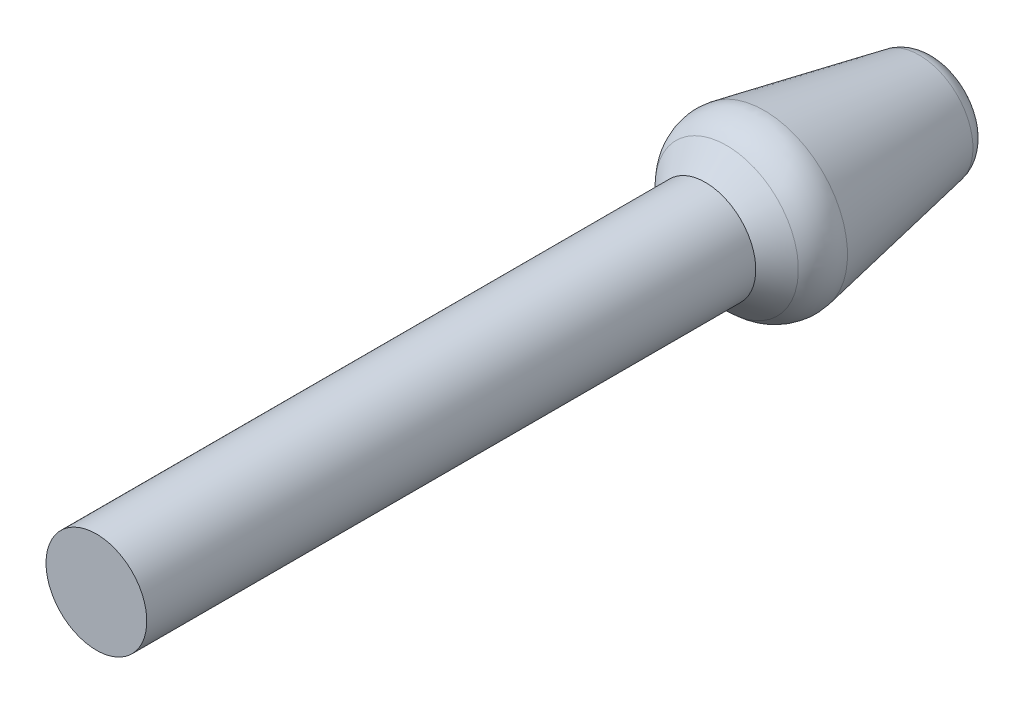
ISO-10303-21;
HEADER;
FILE_DESCRIPTION(('STEP AP214'),'2;1');
FILE_NAME('part.step','',(''),(''),'','','');
FILE_SCHEMA(('AUTOMOTIVE_DESIGN { 1 0 10303 214 1 1 1 1 }'));
ENDSEC;
DATA;
#1=APPLICATION_CONTEXT('core data for automotive mechanical design processes');
#2=APPLICATION_PROTOCOL_DEFINITION('international standard','automotive_design',2000,#1);
#3=PRODUCT_CONTEXT('',#1,'mechanical');
#4=PRODUCT('Part','Part','',(#3));
#5=PRODUCT_RELATED_PRODUCT_CATEGORY('part','',(#4));
#6=PRODUCT_DEFINITION_FORMATION('','',#4);
#7=PRODUCT_DEFINITION_CONTEXT('part definition',#1,'design');
#8=PRODUCT_DEFINITION('design','',#6,#7);
#9=PRODUCT_DEFINITION_SHAPE('','',#8);
#10=(LENGTH_UNIT() NAMED_UNIT(*) SI_UNIT(.MILLI.,.METRE.));
#11=(NAMED_UNIT(*) PLANE_ANGLE_UNIT() SI_UNIT($,.RADIAN.));
#12=(NAMED_UNIT(*) SI_UNIT($,.STERADIAN.) SOLID_ANGLE_UNIT());
#13=UNCERTAINTY_MEASURE_WITH_UNIT(LENGTH_MEASURE(1.E-05),#10,'distance_accuracy_value','');
#14=(GEOMETRIC_REPRESENTATION_CONTEXT(3) GLOBAL_UNCERTAINTY_ASSIGNED_CONTEXT((#13)) GLOBAL_UNIT_ASSIGNED_CONTEXT((#10,
#11,#12)) REPRESENTATION_CONTEXT('',''));
#15=CARTESIAN_POINT('',(0.,0.,0.));
#16=DIRECTION('',(0.,0.,1.));
#17=DIRECTION('',(1.,0.,0.));
#18=AXIS2_PLACEMENT_3D('',#15,#16,#17);
#19=CARTESIAN_POINT('',(-0.991133152501453,0.,-37.9508523224883));
#20=CARTESIAN_POINT('',(-0.991133152501453,-0.991133152501453,-37.9508523224883));
#21=CARTESIAN_POINT('',(0.,-0.991133152501453,-37.9508523224883));
#22=CARTESIAN_POINT('',(0.991133152501453,-0.991133152501453,-37.9508523224883));
#23=CARTESIAN_POINT('',(0.991133152501453,0.,-37.9508523224883));
#24=CARTESIAN_POINT('',(0.991133152501453,0.991133152501453,-37.9508523224883));
#25=CARTESIAN_POINT('',(0.,0.991133152501453,-37.9508523224883));
#26=CARTESIAN_POINT('',(-0.991133152501453,0.991133152501453,-37.9508523224883));
#27=CARTESIAN_POINT('',(-0.991133152501453,0.,-37.9508523224883));
#28=CARTESIAN_POINT('',(-1.0407755681846,0.,-37.6907755681845));
#29=CARTESIAN_POINT('',(-1.0407755681846,-1.0407755681846,-37.6907755681845));
#30=CARTESIAN_POINT('',(0.,-1.0407755681846,-37.6907755681845));
#31=CARTESIAN_POINT('',(1.0407755681846,-1.0407755681846,-37.6907755681845));
#32=CARTESIAN_POINT('',(1.0407755681846,0.,-37.6907755681845));
#33=CARTESIAN_POINT('',(1.0407755681846,1.0407755681846,-37.6907755681845));
#34=CARTESIAN_POINT('',(0.,1.0407755681846,-37.6907755681845));
#35=CARTESIAN_POINT('',(-1.0407755681846,1.0407755681846,-37.6907755681845));
#36=CARTESIAN_POINT('',(-1.0407755681846,0.,-37.6907755681845));
#37=CARTESIAN_POINT('',(-0.853553390593273,0.,-37.5035533905931));
#38=CARTESIAN_POINT('',(-0.853553390593274,-0.853553390593274,-37.5035533905931));
#39=CARTESIAN_POINT('',(0.,-0.853553390593273,-37.5035533905931));
#40=CARTESIAN_POINT('',(0.853553390593274,-0.853553390593274,-37.5035533905931));
#41=CARTESIAN_POINT('',(0.853553390593273,0.,-37.5035533905931));
#42=CARTESIAN_POINT('',(0.853553390593274,0.853553390593274,-37.5035533905931));
#43=CARTESIAN_POINT('',(0.,0.853553390593273,-37.5035533905931));
#44=CARTESIAN_POINT('',(-0.853553390593274,0.853553390593274,-37.5035533905931));
#45=CARTESIAN_POINT('',(-0.853553390593273,0.,-37.5035533905931));
#46=(BOUNDED_SURFACE() B_SPLINE_SURFACE(2,2,((#19,#20,#21,#22,#23,#24,#25,#26,#27),(#28,#29,#30,
#31,#32,#33,#34,#35,#36),(#37,#38,#39,#40,#41,#42,#43,#44,#45)),.UNSPECIFIED.,.F.,.T.,
.F.) B_SPLINE_SURFACE_WITH_KNOTS((3,3),(3,2,2,2,3),(-0.188607307777934,0.78539816339745),
(-3.14159265358979,-1.5707963267949,0.,1.5707963267949,3.14159265358979),
.UNSPECIFIED.) GEOMETRIC_REPRESENTATION_ITEM() RATIONAL_B_SPLINE_SURFACE(((1.,0.707106781186548,
1.,0.707106781186548,1.,0.707106781186548,1.,0.707106781186548,1.),(0.883739483467103,
0.624898181561885,0.883739483467103,0.624898181561885,0.883739483467103,0.624898181561885,
0.883739483467103,0.624898181561885,0.883739483467103),(1.,0.707106781186548,1.,
0.707106781186548,1.,0.707106781186548,1.,0.707106781186548,1.))) REPRESENTATION_ITEM('') SURFACE());
#47=CARTESIAN_POINT('',(0.,0.,-37.5035533905931));
#48=DIRECTION('',(0.,0.,1.));
#49=DIRECTION('',(1.,0.,0.));
#50=AXIS2_PLACEMENT_3D('',#47,#48,#49);
#51=CIRCLE('',#50,0.853553390593273);
#52=CARTESIAN_POINT('',(-0.853553390593273,0.,-37.5035533905931));
#53=VERTEX_POINT('',#52);
#54=EDGE_CURVE('E73',#53,#53,#51,.T.);
#55=CARTESIAN_POINT('',(-0.5,0.,-37.8571067811864));
#56=DIRECTION('',(0.,-1.,0.));
#57=DIRECTION('',(-1.,0.,0.));
#58=AXIS2_PLACEMENT_3D('',#55,#56,#57);
#59=CIRCLE('',#58,0.5);
#60=CARTESIAN_POINT('',(-0.991133152501452,0.,-37.9508523224883));
#61=VERTEX_POINT('',#60);
#62=EDGE_CURVE('E11',#53,#61,#59,.T.);
#63=CARTESIAN_POINT('',(0.,0.,-37.9508523224883));
#64=DIRECTION('',(0.,0.,1.));
#65=DIRECTION('',(1.,0.,0.));
#66=AXIS2_PLACEMENT_3D('',#63,#64,#65);
#67=CIRCLE('',#66,0.991133152501453);
#68=EDGE_CURVE('E20',#61,#61,#67,.T.);
#69=ORIENTED_EDGE('',*,*,#54,.F.);
#70=ORIENTED_EDGE('',*,*,#62,.T.);
#71=ORIENTED_EDGE('',*,*,#68,.T.);
#72=ORIENTED_EDGE('',*,*,#62,.F.);
#73=EDGE_LOOP('',(#69,#70,#71,#72));
#74=FACE_BOUND('',#73,.T.);
#75=ADVANCED_FACE('F16',(#74),#46,.F.);
#76=CARTESIAN_POINT('',(0.,0.,-38.8738625465696));
#77=DIRECTION('',(0.,0.,1.));
#78=DIRECTION('',(1.,0.,0.));
#79=AXIS2_PLACEMENT_3D('',#76,#77,#78);
#80=CONICAL_SURFACE('',#79,0.814952634768153,0.188607307777948);
#81=ORIENTED_EDGE('',*,*,#68,.F.);
#82=DIRECTION('',(0.187491082603802,0.,-0.982266305002902));
#83=VECTOR('',#82,1.);
#84=CARTESIAN_POINT('',(-0.814952634768153,0.,-38.8738625465696));
#85=LINE('',#84,#83);
#86=CARTESIAN_POINT('',(-0.638772117034854,0.,-39.7968727706509));
#87=VERTEX_POINT('',#86);
#88=EDGE_CURVE('E27',#61,#87,#85,.T.);
#89=ORIENTED_EDGE('',*,*,#88,.T.);
#90=CARTESIAN_POINT('',(0.,0.,-39.7968727706509));
#91=DIRECTION('',(0.,0.,1.));
#92=DIRECTION('',(1.,0.,0.));
#93=AXIS2_PLACEMENT_3D('',#90,#91,#92);
#94=CIRCLE('',#93,0.638772117034854);
#95=EDGE_CURVE('E85',#87,#87,#94,.T.);
#96=ORIENTED_EDGE('',*,*,#95,.T.);
#97=ORIENTED_EDGE('',*,*,#88,.F.);
#98=EDGE_LOOP('',(#81,#89,#96,#97));
#99=FACE_BOUND('',#98,.T.);
#100=ADVANCED_FACE('F18',(#99),#80,.T.);
#101=CARTESIAN_POINT('',(0.,0.,-39.75));
#102=DIRECTION('',(0.,0.,1.));
#103=DIRECTION('',(1.,0.,0.));
#104=AXIS2_PLACEMENT_3D('',#101,#102,#103);
#105=TOROIDAL_SURFACE('',#104,0.393205540784129,0.25);
#106=ORIENTED_EDGE('',*,*,#95,.F.);
#107=CARTESIAN_POINT('',(-0.393205540784129,0.,-39.75));
#108=DIRECTION('',(0.,-1.,0.));
#109=DIRECTION('',(-1.,0.,0.));
#110=AXIS2_PLACEMENT_3D('',#107,#108,#109);
#111=CIRCLE('',#110,0.25);
#112=CARTESIAN_POINT('',(-0.393205540784129,0.,-40.));
#113=VERTEX_POINT('',#112);
#114=EDGE_CURVE('E89',#87,#113,#111,.T.);
#115=ORIENTED_EDGE('',*,*,#114,.T.);
#116=CARTESIAN_POINT('',(0.,0.,-40.));
#117=DIRECTION('',(0.,0.,1.));
#118=DIRECTION('',(1.,0.,0.));
#119=AXIS2_PLACEMENT_3D('',#116,#117,#118);
#120=CIRCLE('',#119,0.393205540784129);
#121=EDGE_CURVE('E67',#113,#113,#120,.T.);
#122=ORIENTED_EDGE('',*,*,#121,.T.);
#123=ORIENTED_EDGE('',*,*,#114,.F.);
#124=EDGE_LOOP('',(#106,#115,#122,#123));
#125=FACE_BOUND('',#124,.T.);
#126=ADVANCED_FACE('F107',(#125),#105,.T.);
#127=CARTESIAN_POINT('',(0.393205540784129,0.,-40.));
#128=DIRECTION('',(0.,0.,-1.));
#129=DIRECTION('',(0.,-1.,0.));
#130=AXIS2_PLACEMENT_3D('',#127,#128,#129);
#131=PLANE('',#130);
#132=ORIENTED_EDGE('',*,*,#121,.F.);
#133=EDGE_LOOP('',(#132));
#134=FACE_BOUND('',#133,.T.);
#135=ADVANCED_FACE('F110',(#134),#131,.T.);
#136=CARTESIAN_POINT('',(0.,0.,-30.));
#137=DIRECTION('',(0.,0.,1.));
#138=DIRECTION('',(1.,0.,0.));
#139=AXIS2_PLACEMENT_3D('',#136,#137,#138);
#140=PLANE('',#139);
#141=CARTESIAN_POINT('',(0.,0.,-30.));
#142=DIRECTION('',(0.,0.,1.));
#143=DIRECTION('',(1.,0.,0.));
#144=AXIS2_PLACEMENT_3D('',#141,#142,#143);
#145=CIRCLE('',#144,0.6);
#146=CARTESIAN_POINT('',(-0.6,0.,-30.));
#147=VERTEX_POINT('',#146);
#148=EDGE_CURVE('E65',#147,#147,#145,.T.);
#149=ORIENTED_EDGE('',*,*,#148,.T.);
#150=EDGE_LOOP('',(#149));
#151=FACE_BOUND('',#150,.T.);
#152=ADVANCED_FACE('F112',(#151),#140,.T.);
#153=CARTESIAN_POINT('',(0.,0.,-33.625));
#154=DIRECTION('',(0.,0.,1.));
#155=DIRECTION('',(1.,0.,0.));
#156=AXIS2_PLACEMENT_3D('',#153,#154,#155);
#157=CYLINDRICAL_SURFACE('',#156,0.6);
#158=ORIENTED_EDGE('',*,*,#148,.F.);
#159=DIRECTION('',(0.,0.,-1.));
#160=VECTOR('',#159,1.);
#161=CARTESIAN_POINT('',(-0.6,0.,-33.625));
#162=LINE('',#161,#160);
#163=CARTESIAN_POINT('',(-0.6,0.,-37.25));
#164=VERTEX_POINT('',#163);
#165=EDGE_CURVE('E59',#147,#164,#162,.T.);
#166=ORIENTED_EDGE('',*,*,#165,.T.);
#167=CARTESIAN_POINT('',(0.,0.,-37.25));
#168=DIRECTION('',(0.,0.,1.));
#169=DIRECTION('',(1.,0.,0.));
#170=AXIS2_PLACEMENT_3D('',#167,#168,#169);
#171=CIRCLE('',#170,0.6);
#172=EDGE_CURVE('E63',#164,#164,#171,.T.);
#173=ORIENTED_EDGE('',*,*,#172,.T.);
#174=ORIENTED_EDGE('',*,*,#165,.F.);
#175=EDGE_LOOP('',(#158,#166,#173,#174));
#176=FACE_BOUND('',#175,.T.);
#177=ADVANCED_FACE('F61',(#176),#157,.T.);
#178=CARTESIAN_POINT('',(0.,0.,-37.3767766952966));
#179=DIRECTION('',(0.,0.,-1.));
#180=DIRECTION('',(1.,0.,0.));
#181=AXIS2_PLACEMENT_3D('',#178,#179,#180);
#182=CONICAL_SURFACE('',#181,0.726776695296635,0.785398163397746);
#183=ORIENTED_EDGE('',*,*,#172,.F.);
#184=DIRECTION('',(-0.707106781186758,0.,-0.707106781186337));
#185=VECTOR('',#184,1.);
#186=CARTESIAN_POINT('',(-0.726776695296635,0.,-37.3767766952966));
#187=LINE('',#186,#185);
#188=EDGE_CURVE('E71',#164,#53,#187,.T.);
#189=ORIENTED_EDGE('',*,*,#188,.T.);
#190=ORIENTED_EDGE('',*,*,#54,.T.);
#191=ORIENTED_EDGE('',*,*,#188,.F.);
#192=EDGE_LOOP('',(#183,#189,#190,#191));
#193=FACE_BOUND('',#192,.T.);
#194=ADVANCED_FACE('F72',(#193),#182,.T.);
#195=CLOSED_SHELL('',(#75,#100,#126,#135,#152,#177,#194));
#196=MANIFOLD_SOLID_BREP('B1',#195);
#197=ADVANCED_BREP_SHAPE_REPRESENTATION('',(#18,#196),#14);
#198=SHAPE_DEFINITION_REPRESENTATION(#9,#197);
ENDSEC;
END-ISO-10303-21;
